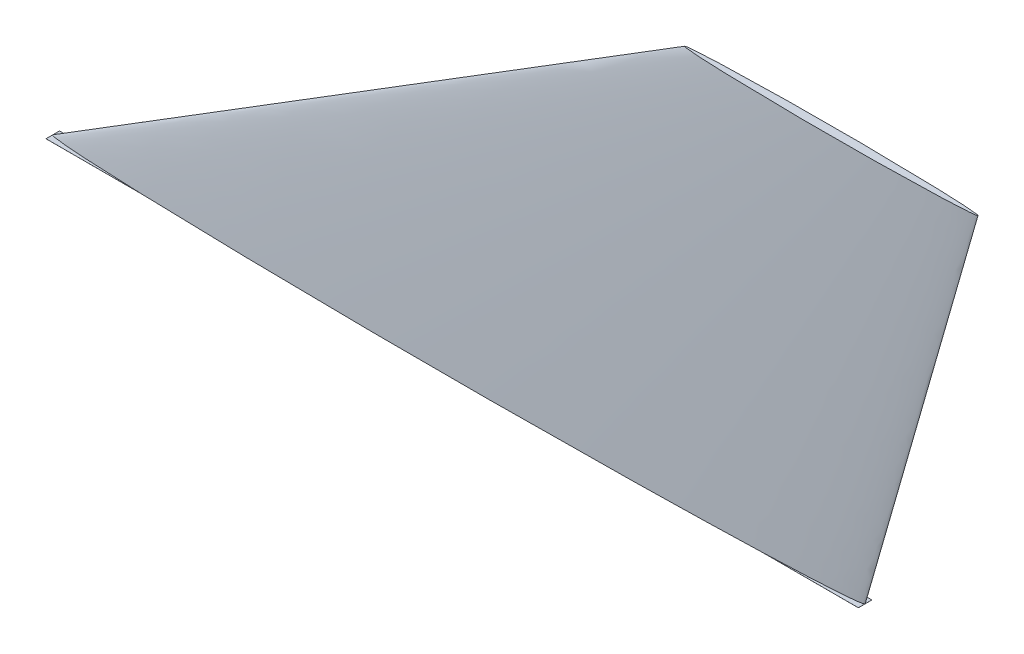
ISO-10303-21;
HEADER;
FILE_DESCRIPTION(('STEP AP214'),'2;1');
FILE_NAME('part.step','',(''),(''),'','','');
FILE_SCHEMA(('AUTOMOTIVE_DESIGN { 1 0 10303 214 1 1 1 1 }'));
ENDSEC;
DATA;
#1=APPLICATION_CONTEXT('core data for automotive mechanical design processes');
#2=APPLICATION_PROTOCOL_DEFINITION('international standard','automotive_design',2000,#1);
#3=PRODUCT_CONTEXT('',#1,'mechanical');
#4=PRODUCT('Part','Part','',(#3));
#5=PRODUCT_RELATED_PRODUCT_CATEGORY('part','',(#4));
#6=PRODUCT_DEFINITION_FORMATION('','',#4);
#7=PRODUCT_DEFINITION_CONTEXT('part definition',#1,'design');
#8=PRODUCT_DEFINITION('design','',#6,#7);
#9=PRODUCT_DEFINITION_SHAPE('','',#8);
#10=(LENGTH_UNIT() NAMED_UNIT(*) SI_UNIT(.MILLI.,.METRE.));
#11=(NAMED_UNIT(*) PLANE_ANGLE_UNIT() SI_UNIT($,.RADIAN.));
#12=(NAMED_UNIT(*) SI_UNIT($,.STERADIAN.) SOLID_ANGLE_UNIT());
#13=UNCERTAINTY_MEASURE_WITH_UNIT(LENGTH_MEASURE(1.E-05),#10,'distance_accuracy_value','');
#14=(GEOMETRIC_REPRESENTATION_CONTEXT(3) GLOBAL_UNCERTAINTY_ASSIGNED_CONTEXT((#13)) GLOBAL_UNIT_ASSIGNED_CONTEXT((#10,
#11,#12)) REPRESENTATION_CONTEXT('',''));
#15=CARTESIAN_POINT('',(0.,0.,0.));
#16=DIRECTION('',(0.,0.,1.));
#17=DIRECTION('',(1.,0.,0.));
#18=AXIS2_PLACEMENT_3D('',#15,#16,#17);
#19=CARTESIAN_POINT('',(0.,0.,1.5));
#20=DIRECTION('',(0.,1.,0.));
#21=DIRECTION('',(-1.,0.,0.));
#22=AXIS2_PLACEMENT_3D('',#19,#20,#21);
#23=PLANE('',#22);
#24=DIRECTION('',(0.,0.,-1.));
#25=VECTOR('',#24,1.);
#26=CARTESIAN_POINT('',(0.,0.,1.5));
#27=LINE('',#26,#25);
#28=CARTESIAN_POINT('',(-3.00516227955869E-07,0.,-0.000236915683359726));
#29=VERTEX_POINT('',#28);
#30=CARTESIAN_POINT('',(0.,0.,-1.5));
#31=VERTEX_POINT('',#30);
#32=EDGE_CURVE('E190',#29,#31,#27,.T.);
#33=ORIENTED_EDGE('',*,*,#32,.F.);
#34=CARTESIAN_POINT('',(180.,0.,0.));
#35=CARTESIAN_POINT('',(180.,0.,-1.25));
#36=CARTESIAN_POINT('',(90.,0.,-3.74999999999997));
#37=CARTESIAN_POINT('',(-45.,0.,0.));
#38=CARTESIAN_POINT('',(90.,0.,3.75000000000003));
#39=CARTESIAN_POINT('',(180.,0.,1.25));
#40=CARTESIAN_POINT('',(180.,0.,0.));
#41=B_SPLINE_CURVE_WITH_KNOTS('',3,(#34,#35,#36,#37,#38,#39,#40),.UNSPECIFIED.,.T.,.F.,(4,1,1,1,
4),(0.,0.25,0.5,0.75,1.),.UNSPECIFIED.);
#42=CARTESIAN_POINT('',(20.9948632143065,0.,-1.49999947655607));
#43=VERTEX_POINT('',#42);
#44=EDGE_CURVE('E12',#29,#43,#41,.F.);
#45=ORIENTED_EDGE('',*,*,#44,.T.);
#46=DIRECTION('',(1.,0.,0.));
#47=VECTOR('',#46,1.);
#48=CARTESIAN_POINT('',(0.,0.,-1.5));
#49=LINE('',#48,#47);
#50=EDGE_CURVE('E169',#31,#43,#49,.T.);
#51=ORIENTED_EDGE('',*,*,#50,.F.);
#52=EDGE_LOOP('',(#33,#45,#51));
#53=FACE_BOUND('',#52,.T.);
#54=ADVANCED_FACE('F62',(#53),#23,.T.);
#55=DIRECTION('',(1.,0.,0.));
#56=VECTOR('',#55,1.);
#57=CARTESIAN_POINT('',(0.,0.,1.5));
#58=LINE('',#57,#56);
#59=CARTESIAN_POINT('',(0.,0.,1.5));
#60=VERTEX_POINT('',#59);
#61=CARTESIAN_POINT('',(20.9948473906053,0.,1.4999992082196));
#62=VERTEX_POINT('',#61);
#63=EDGE_CURVE('E199',#60,#62,#58,.T.);
#64=ORIENTED_EDGE('',*,*,#63,.T.);
#65=CARTESIAN_POINT('',(180.,0.,0.));
#66=CARTESIAN_POINT('',(180.,0.,-1.25));
#67=CARTESIAN_POINT('',(90.,0.,-3.74999999999997));
#68=CARTESIAN_POINT('',(-45.,0.,0.));
#69=CARTESIAN_POINT('',(90.,0.,3.75000000000003));
#70=CARTESIAN_POINT('',(180.,0.,1.25));
#71=CARTESIAN_POINT('',(180.,0.,0.));
#72=B_SPLINE_CURVE_WITH_KNOTS('',3,(#65,#66,#67,#68,#69,#70,#71),.UNSPECIFIED.,.T.,.F.,(4,1,1,1,
4),(0.,0.25,0.5,0.75,1.),.UNSPECIFIED.);
#73=EDGE_CURVE('E77',#62,#29,#72,.F.);
#74=ORIENTED_EDGE('',*,*,#73,.T.);
#75=EDGE_CURVE('E122',#60,#29,#27,.T.);
#76=ORIENTED_EDGE('',*,*,#75,.F.);
#77=EDGE_LOOP('',(#64,#74,#76));
#78=FACE_BOUND('',#77,.T.);
#79=ADVANCED_FACE('F279',(#78),#23,.T.);
#80=DIRECTION('',(0.,0.,-1.));
#81=VECTOR('',#80,1.);
#82=CARTESIAN_POINT('',(180.,0.,1.5));
#83=LINE('',#82,#81);
#84=CARTESIAN_POINT('',(180.,0.,1.5));
#85=VERTEX_POINT('',#84);
#86=CARTESIAN_POINT('',(180.,0.,0.));
#87=VERTEX_POINT('',#86);
#88=EDGE_CURVE('E252',#85,#87,#83,.T.);
#89=ORIENTED_EDGE('',*,*,#88,.T.);
#90=CARTESIAN_POINT('',(180.,0.,0.));
#91=CARTESIAN_POINT('',(180.00003194274,0.,0.0058341566190591));
#92=CARTESIAN_POINT('',(179.999015002208,0.,0.0115342311181985));
#93=CARTESIAN_POINT('',(179.995978892275,0.,0.0208296321557102));
#94=CARTESIAN_POINT('',(179.994346602934,0.,0.0245476575088893));
#95=CARTESIAN_POINT('',(179.990511102323,0.,0.0316878583168842));
#96=CARTESIAN_POINT('',(179.988304739645,0.,0.0351082570966009));
#97=CARTESIAN_POINT('',(179.981595930065,0.,0.0442595478431978));
#98=CARTESIAN_POINT('',(179.97666127163,0.,0.0496688643945603));
#99=CARTESIAN_POINT('',(179.966120611166,0.,0.0597706538644289));
#100=CARTESIAN_POINT('',(179.960512916315,0.,0.064461248695845));
#101=CARTESIAN_POINT('',(179.944988630818,0.,0.0763069242027554));
#102=CARTESIAN_POINT('',(179.934716754431,0.,0.0829905004052215));
#103=CARTESIAN_POINT('',(179.913622524095,0.,0.0954375554323035));
#104=CARTESIAN_POINT('',(179.902798819149,0.,0.101198617571555));
#105=CARTESIAN_POINT('',(179.8807710012,0.,0.112100991094293));
#106=CARTESIAN_POINT('',(179.869565113808,0.,0.117238694540508));
#107=CARTESIAN_POINT('',(179.846961679659,0.,0.127021553004982));
#108=CARTESIAN_POINT('',(179.835564410096,0.,0.131667359351637));
#109=CARTESIAN_POINT('',(179.797007602315,0.,0.146673085192501));
#110=CARTESIAN_POINT('',(179.769524068209,0.,0.156196644372424));
#111=CARTESIAN_POINT('',(179.714153213338,0.,0.173999018357764));
#112=CARTESIAN_POINT('',(179.686265641064,0.,0.182277017807893));
#113=CARTESIAN_POINT('',(179.602133900619,0.,0.205859106603337));
#114=CARTESIAN_POINT('',(179.54553023849,0.,0.219873239388183));
#115=CARTESIAN_POINT('',(179.431965997884,0.,0.245927530274084));
#116=CARTESIAN_POINT('',(179.375005951146,0.,0.257970122860664));
#117=CARTESIAN_POINT('',(179.260894130694,0.,0.280700916872883));
#118=CARTESIAN_POINT('',(179.203742703002,0.,0.29139086066484));
#119=CARTESIAN_POINT('',(179.032836095235,0.,0.321886905558186));
#120=CARTESIAN_POINT('',(178.918832933791,0.,0.340288619022787));
#121=CARTESIAN_POINT('',(178.690473216461,0.,0.374784291108296));
#122=CARTESIAN_POINT('',(178.576116615802,0.,0.390877943987018));
#123=CARTESIAN_POINT('',(178.347089693213,0.,0.421448198897907));
#124=CARTESIAN_POINT('',(178.232419187199,0.,0.435923414214748));
#125=CARTESIAN_POINT('',(178.002938675267,0.,0.463651380387157));
#126=CARTESIAN_POINT('',(177.888128677643,0.,0.476904200635924));
#127=CARTESIAN_POINT('',(177.543747361815,0.,0.515217891838368));
#128=CARTESIAN_POINT('',(177.314018556221,0.,0.538860379192033));
#129=CARTESIAN_POINT('',(176.854409581859,0.,0.583589280831693));
#130=CARTESIAN_POINT('',(176.624529509075,0.,0.60467670376833));
#131=CARTESIAN_POINT('',(176.088352042547,0.,0.651651499155311));
#132=CARTESIAN_POINT('',(175.781991173806,0.,0.676811885597152));
#133=CARTESIAN_POINT('',(175.169080812581,0.,0.724738713533969));
#134=CARTESIAN_POINT('',(174.862531317603,0.,0.747505122680649));
#135=CARTESIAN_POINT('',(174.249231296059,0.,0.791199202494685));
#136=CARTESIAN_POINT('',(173.94248073952,0.,0.81212645051691));
#137=CARTESIAN_POINT('',(173.328882052095,0.,0.85250296326033));
#138=CARTESIAN_POINT('',(173.022033920909,0.,0.871952223398617));
#139=CARTESIAN_POINT('',(172.101331218847,0.,0.928487607070929));
#140=CARTESIAN_POINT('',(171.487365176571,0.,0.963758086863956));
#141=CARTESIAN_POINT('',(170.259125076588,0.,1.030794945731));
#142=CARTESIAN_POINT('',(169.644850982196,0.,1.06256064174883));
#143=CARTESIAN_POINT('',(168.416227726587,0.,1.12335248557393));
#144=CARTESIAN_POINT('',(167.801878578475,0.,1.15237889943321));
#145=CARTESIAN_POINT('',(166.573092977084,0.,1.20821797299169));
#146=CARTESIAN_POINT('',(165.958656525879,0.,1.23503067857113));
#147=CARTESIAN_POINT('',(164.992013855864,0.,1.27575360601992));
#148=CARTESIAN_POINT('',(164.639833644543,0.,1.29028564519159));
#149=CARTESIAN_POINT('',(163.935443727158,0.,1.31879381442946));
#150=CARTESIAN_POINT('',(163.583234020648,0.,1.33276993348927));
#151=CARTESIAN_POINT('',(162.87879115192,0.,1.36021188543847));
#152=CARTESIAN_POINT('',(162.526557989498,0.,1.37367771310598));
#153=CARTESIAN_POINT('',(161.822203872852,0.,1.40013265891598));
#154=CARTESIAN_POINT('',(161.470082925157,0.,1.41312195105177));
#155=CARTESIAN_POINT('',(160.76582888504,0.,1.43866255081773));
#156=CARTESIAN_POINT('',(160.413695792786,0.,1.4512138630693));
#157=CARTESIAN_POINT('',(159.709422867787,0.,1.47590664451188));
#158=CARTESIAN_POINT('',(159.357283035355,0.,1.48804812257179));
#159=CARTESIAN_POINT('',(159.005136767936,0.,1.49999895311192));
#160=B_SPLINE_CURVE_WITH_KNOTS('',3,(#90,#91,#92,#93,#94,#95,#96,#97,#98,#99,#100,#101,#102,
#103,#104,#105,#106,#107,#108,#109,#110,#111,#112,#113,#114,#115,#116,#117,#118,#119,#120,#121,
#122,#123,#124,#125,#126,#127,#128,#129,#130,#131,#132,#133,#134,#135,#136,#137,#138,#139,#140,
#141,#142,#143,#144,#145,#146,#147,#148,#149,#150,#151,#152,#153,#154,#155,#156,#157,#158,#159),
.UNSPECIFIED.,.F.,.F.,(4,2,2,2,2,2,2,2,2,2,2,2,2,2,2,2,2,2,2,2,2,2,2,2,2,2,2,2,2,2,2,2,2,2,4),
(0.,0.0172154145000537,0.0293230522494076,0.0414986118057946,0.0633406468033029,
0.0852388179121147,0.121906244700601,0.158668209899729,0.195633712792967,0.232549640315073,
0.319749354041716,0.407005903493326,0.581866163804553,0.756508848500208,0.930924232415855,
1.2773160734175,1.6237537576564,1.97048603916085,2.3171986251588,3.01000034825787,
3.70252768003685,4.62469003343515,5.54686484582714,6.46925102581821,7.39164006580354,
9.23655898980707,11.0818368419603,12.9269352871715,14.7719954821675,15.8294348059092,
16.8868950549816,17.9443661223021,19.0014471617872,20.0585170439463,21.1155640361832),.UNSPECIFIED.);
#161=CARTESIAN_POINT('',(159.005136785699,0.,1.49999947655598));
#162=VERTEX_POINT('',#161);
#163=EDGE_CURVE('E84',#87,#162,#160,.T.);
#164=ORIENTED_EDGE('',*,*,#163,.T.);
#165=EDGE_CURVE('E92',#162,#85,#58,.T.);
#166=ORIENTED_EDGE('',*,*,#165,.T.);
#167=EDGE_LOOP('',(#89,#164,#166));
#168=FACE_BOUND('',#167,.T.);
#169=ADVANCED_FACE('F281',(#168),#23,.T.);
#170=CARTESIAN_POINT('',(159.00515260939,0.,-1.49999920821966));
#171=VERTEX_POINT('',#170);
#172=CARTESIAN_POINT('',(180.,0.,-1.5));
#173=VERTEX_POINT('',#172);
#174=EDGE_CURVE('E158',#171,#173,#49,.T.);
#175=ORIENTED_EDGE('',*,*,#174,.F.);
#176=CARTESIAN_POINT('',(180.,0.,0.));
#177=CARTESIAN_POINT('',(180.,0.,-1.25));
#178=CARTESIAN_POINT('',(90.,0.,-3.74999999999997));
#179=CARTESIAN_POINT('',(-45.,0.,0.));
#180=CARTESIAN_POINT('',(90.,0.,3.75000000000003));
#181=CARTESIAN_POINT('',(180.,0.,1.25));
#182=CARTESIAN_POINT('',(180.,0.,0.));
#183=B_SPLINE_CURVE_WITH_KNOTS('',3,(#176,#177,#178,#179,#180,#181,#182),.UNSPECIFIED.,.T.,.F.,
(4,1,1,1,4),(0.,0.25,0.5,0.75,1.),.UNSPECIFIED.);
#184=EDGE_CURVE('E148',#87,#171,#183,.T.);
#185=ORIENTED_EDGE('',*,*,#184,.F.);
#186=EDGE_CURVE('E114',#87,#173,#83,.T.);
#187=ORIENTED_EDGE('',*,*,#186,.T.);
#188=EDGE_LOOP('',(#175,#185,#187));
#189=FACE_BOUND('',#188,.T.);
#190=ADVANCED_FACE('F159',(#189),#23,.T.);
#191=CARTESIAN_POINT('',(0.,0.,1.5));
#192=DIRECTION('',(-1.,0.,0.));
#193=DIRECTION('',(0.,0.,1.));
#194=AXIS2_PLACEMENT_3D('',#191,#192,#193);
#195=PLANE('',#194);
#196=DIRECTION('',(0.,1.,0.));
#197=VECTOR('',#196,1.);
#198=CARTESIAN_POINT('',(0.,0.,-1.5));
#199=LINE('',#198,#197);
#200=CARTESIAN_POINT('',(0.,-0.00999999999999959,-1.5));
#201=VERTEX_POINT('',#200);
#202=EDGE_CURVE('E175',#201,#31,#199,.T.);
#203=ORIENTED_EDGE('',*,*,#202,.F.);
#204=DIRECTION('',(0.,0.,-1.));
#205=VECTOR('',#204,1.);
#206=CARTESIAN_POINT('',(0.,-0.00999999999999959,1.5));
#207=LINE('',#206,#205);
#208=CARTESIAN_POINT('',(0.,-0.00999999999999959,1.5));
#209=VERTEX_POINT('',#208);
#210=EDGE_CURVE('E193',#209,#201,#207,.T.);
#211=ORIENTED_EDGE('',*,*,#210,.F.);
#212=DIRECTION('',(0.,1.,0.));
#213=VECTOR('',#212,1.);
#214=CARTESIAN_POINT('',(0.,0.,1.5));
#215=LINE('',#214,#213);
#216=EDGE_CURVE('E205',#209,#60,#215,.T.);
#217=ORIENTED_EDGE('',*,*,#216,.T.);
#218=ORIENTED_EDGE('',*,*,#75,.T.);
#219=ORIENTED_EDGE('',*,*,#32,.T.);
#220=EDGE_LOOP('',(#203,#211,#217,#218,#219));
#221=FACE_BOUND('',#220,.T.);
#222=ADVANCED_FACE('F270',(#221),#195,.T.);
#223=CARTESIAN_POINT('',(0.,-0.00999999999999959,1.5));
#224=DIRECTION('',(0.,-1.,0.));
#225=DIRECTION('',(1.,0.,0.));
#226=AXIS2_PLACEMENT_3D('',#223,#224,#225);
#227=PLANE('',#226);
#228=DIRECTION('',(-1.,0.,0.));
#229=VECTOR('',#228,1.);
#230=CARTESIAN_POINT('',(0.,-0.00999999999999959,-1.5));
#231=LINE('',#230,#229);
#232=CARTESIAN_POINT('',(180.,-0.00999999999997878,-1.5));
#233=VERTEX_POINT('',#232);
#234=EDGE_CURVE('E245',#233,#201,#231,.T.);
#235=ORIENTED_EDGE('',*,*,#234,.F.);
#236=DIRECTION('',(0.,0.,-1.));
#237=VECTOR('',#236,1.);
#238=CARTESIAN_POINT('',(180.,-0.00999999999997878,1.5));
#239=LINE('',#238,#237);
#240=CARTESIAN_POINT('',(180.,-0.00999999999997878,1.5));
#241=VERTEX_POINT('',#240);
#242=EDGE_CURVE('E250',#241,#233,#239,.T.);
#243=ORIENTED_EDGE('',*,*,#242,.F.);
#244=DIRECTION('',(-1.,0.,0.));
#245=VECTOR('',#244,1.);
#246=CARTESIAN_POINT('',(0.,-0.00999999999999959,1.5));
#247=LINE('',#246,#245);
#248=EDGE_CURVE('E249',#241,#209,#247,.T.);
#249=ORIENTED_EDGE('',*,*,#248,.T.);
#250=ORIENTED_EDGE('',*,*,#210,.T.);
#251=EDGE_LOOP('',(#235,#243,#249,#250));
#252=FACE_BOUND('',#251,.T.);
#253=ADVANCED_FACE('F265',(#252),#227,.T.);
#254=CARTESIAN_POINT('',(180.,0.,1.5));
#255=DIRECTION('',(1.,0.,0.));
#256=DIRECTION('',(0.,0.,-1.));
#257=AXIS2_PLACEMENT_3D('',#254,#255,#256);
#258=PLANE('',#257);
#259=DIRECTION('',(0.,-1.,0.));
#260=VECTOR('',#259,1.);
#261=CARTESIAN_POINT('',(180.,0.,-1.5));
#262=LINE('',#261,#260);
#263=EDGE_CURVE('E209',#173,#233,#262,.T.);
#264=ORIENTED_EDGE('',*,*,#263,.F.);
#265=ORIENTED_EDGE('',*,*,#186,.F.);
#266=ORIENTED_EDGE('',*,*,#88,.F.);
#267=DIRECTION('',(0.,-1.,0.));
#268=VECTOR('',#267,1.);
#269=CARTESIAN_POINT('',(180.,0.,1.5));
#270=LINE('',#269,#268);
#271=EDGE_CURVE('E184',#85,#241,#270,.T.);
#272=ORIENTED_EDGE('',*,*,#271,.T.);
#273=ORIENTED_EDGE('',*,*,#242,.T.);
#274=EDGE_LOOP('',(#264,#265,#266,#272,#273));
#275=FACE_BOUND('',#274,.T.);
#276=ADVANCED_FACE('F274',(#275),#258,.T.);
#277=CARTESIAN_POINT('',(0.,0.,1.5));
#278=DIRECTION('',(0.,0.,1.));
#279=DIRECTION('',(1.,0.,0.));
#280=AXIS2_PLACEMENT_3D('',#277,#278,#279);
#281=PLANE('',#280);
#282=ORIENTED_EDGE('',*,*,#63,.F.);
#283=ORIENTED_EDGE('',*,*,#216,.F.);
#284=ORIENTED_EDGE('',*,*,#248,.F.);
#285=ORIENTED_EDGE('',*,*,#271,.F.);
#286=ORIENTED_EDGE('',*,*,#165,.F.);
#287=EDGE_CURVE('E195',#62,#162,#58,.T.);
#288=ORIENTED_EDGE('',*,*,#287,.F.);
#289=EDGE_LOOP('',(#282,#283,#284,#285,#286,#288));
#290=FACE_BOUND('',#289,.T.);
#291=ADVANCED_FACE('F277',(#290),#281,.T.);
#292=CARTESIAN_POINT('',(0.,0.,-1.5));
#293=DIRECTION('',(0.,0.,1.));
#294=DIRECTION('',(1.,0.,0.));
#295=AXIS2_PLACEMENT_3D('',#292,#293,#294);
#296=PLANE('',#295);
#297=ORIENTED_EDGE('',*,*,#50,.T.);
#298=EDGE_CURVE('E145',#43,#171,#49,.T.);
#299=ORIENTED_EDGE('',*,*,#298,.T.);
#300=ORIENTED_EDGE('',*,*,#174,.T.);
#301=ORIENTED_EDGE('',*,*,#263,.T.);
#302=ORIENTED_EDGE('',*,*,#234,.T.);
#303=ORIENTED_EDGE('',*,*,#202,.T.);
#304=EDGE_LOOP('',(#297,#299,#300,#301,#302,#303));
#305=FACE_BOUND('',#304,.T.);
#306=ADVANCED_FACE('F166',(#305),#296,.F.);
#307=CARTESIAN_POINT('',(0.,0.,0.));
#308=DIRECTION('',(0.,-1.,0.));
#309=DIRECTION('',(0.,0.,-1.));
#310=AXIS2_PLACEMENT_3D('',#307,#308,#309);
#311=PLANE('',#310);
#312=ORIENTED_EDGE('',*,*,#298,.F.);
#313=EDGE_CURVE('E141',#171,#43,#183,.T.);
#314=ORIENTED_EDGE('',*,*,#313,.F.);
#315=EDGE_LOOP('',(#312,#314));
#316=FACE_BOUND('',#315,.T.);
#317=ADVANCED_FACE('F143',(#316),#311,.T.);
#318=CARTESIAN_POINT('',(205.,87.,0.));
#319=DIRECTION('',(0.,1.,0.));
#320=DIRECTION('',(0.,0.,1.));
#321=AXIS2_PLACEMENT_3D('',#318,#319,#320);
#322=PLANE('',#321);
#323=CARTESIAN_POINT('',(140.,87.,0.));
#324=CARTESIAN_POINT('',(140.,87.,0.5));
#325=CARTESIAN_POINT('',(172.5,87.,1.5));
#326=CARTESIAN_POINT('',(221.25,87.,0.));
#327=CARTESIAN_POINT('',(172.5,87.,-1.5));
#328=CARTESIAN_POINT('',(140.,87.,-0.5));
#329=CARTESIAN_POINT('',(140.,87.,0.));
#330=B_SPLINE_CURVE_WITH_KNOTS('',3,(#323,#324,#325,#326,#327,#328,#329),.UNSPECIFIED.,.T.,.F.,
(4,1,1,1,4),(0.,0.25,0.5,0.75,1.),.UNSPECIFIED.);
#331=CARTESIAN_POINT('',(140.,87.,0.));
#332=VERTEX_POINT('',#331);
#333=EDGE_CURVE('E156',#332,#332,#330,.T.);
#334=ORIENTED_EDGE('',*,*,#333,.T.);
#335=EDGE_LOOP('',(#334));
#336=FACE_BOUND('',#335,.T.);
#337=ADVANCED_FACE('F303',(#336),#322,.T.);
#338=EDGE_CURVE('E149',#62,#162,#183,.T.);
#339=ORIENTED_EDGE('',*,*,#338,.F.);
#340=ORIENTED_EDGE('',*,*,#287,.T.);
#341=EDGE_LOOP('',(#339,#340));
#342=FACE_BOUND('',#341,.T.);
#343=ADVANCED_FACE('F306',(#342),#311,.T.);
#344=CARTESIAN_POINT('',(180.,0.,0.));
#345=CARTESIAN_POINT('',(205.,87.,0.));
#346=CARTESIAN_POINT('',(180.,0.,-1.25));
#347=CARTESIAN_POINT('',(205.,87.,-0.5));
#348=CARTESIAN_POINT('',(90.,0.,-3.74999999999997));
#349=CARTESIAN_POINT('',(172.5,87.,-1.5));
#350=CARTESIAN_POINT('',(-45.,0.,0.));
#351=CARTESIAN_POINT('',(123.75,87.,0.));
#352=CARTESIAN_POINT('',(90.,0.,3.75000000000003));
#353=CARTESIAN_POINT('',(172.5,87.,1.5));
#354=CARTESIAN_POINT('',(180.,0.,1.25));
#355=CARTESIAN_POINT('',(205.,87.,0.5));
#356=CARTESIAN_POINT('',(180.,0.,0.));
#357=CARTESIAN_POINT('',(205.,87.,0.));
#358=B_SPLINE_SURFACE_WITH_KNOTS('',3,1,((#344,#345),(#346,#347),(#348,#349),(#350,#351),(#352,
#353),(#354,#355),(#356,#357)),.UNSPECIFIED.,.T.,.F.,.F.,(4,1,1,1,4),(2,2),(0.,0.25,0.5,0.75,
1.),(0.,1.),.UNSPECIFIED.);
#359=ORIENTED_EDGE('',*,*,#184,.T.);
#360=ORIENTED_EDGE('',*,*,#313,.T.);
#361=ORIENTED_EDGE('',*,*,#44,.F.);
#362=ORIENTED_EDGE('',*,*,#73,.F.);
#363=ORIENTED_EDGE('',*,*,#338,.T.);
#364=ORIENTED_EDGE('',*,*,#163,.F.);
#365=EDGE_LOOP('',(#359,#360,#361,#362,#363,#364));
#366=FACE_BOUND('',#365,.T.);
#367=ORIENTED_EDGE('',*,*,#333,.F.);
#368=EDGE_LOOP('',(#367));
#369=FACE_BOUND('',#368,.T.);
#370=ADVANCED_FACE('F153',(#366,#369),#358,.T.);
#371=CLOSED_SHELL('',(#54,#79,#169,#190,#222,#253,#276,#291,#306,#317,#337,#343,#370));
#372=MANIFOLD_SOLID_BREP('B2',#371);
#373=ADVANCED_BREP_SHAPE_REPRESENTATION('',(#18,#372),#14);
#374=SHAPE_DEFINITION_REPRESENTATION(#9,#373);
ENDSEC;
END-ISO-10303-21;
